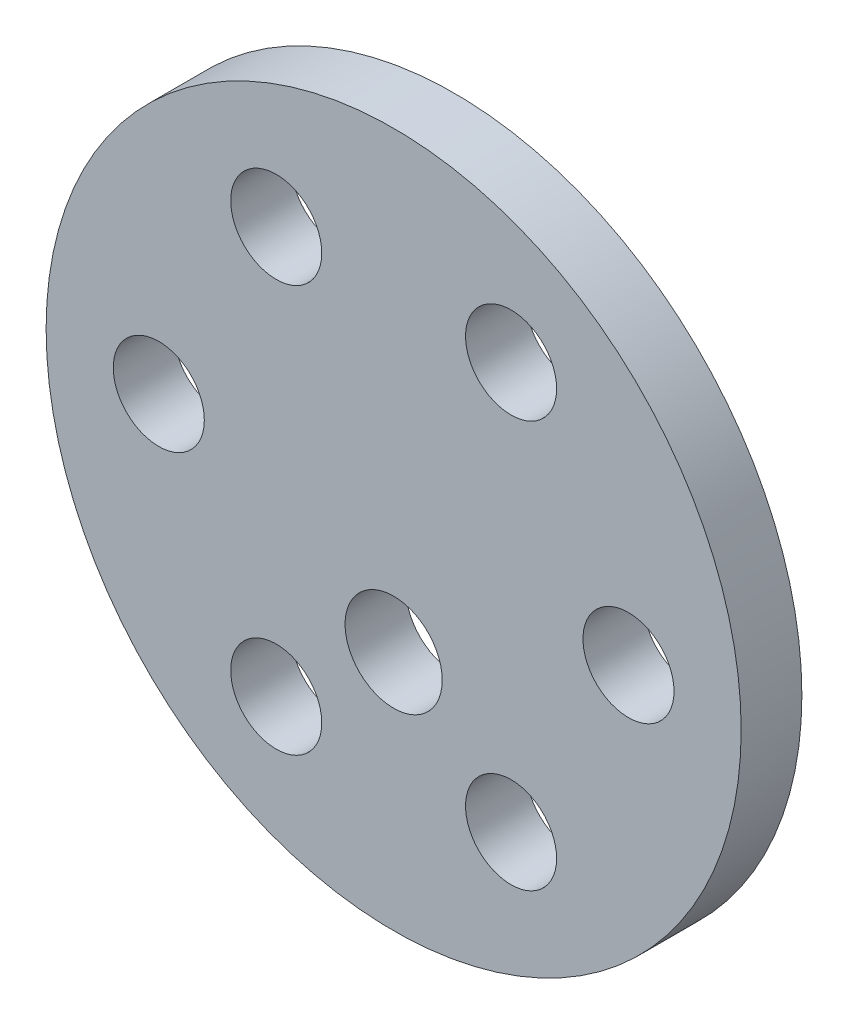
ISO-10303-21;
HEADER;
FILE_DESCRIPTION(('STEP AP214'),'2;1');
FILE_NAME('part.step','',(''),(''),'','','');
FILE_SCHEMA(('AUTOMOTIVE_DESIGN { 1 0 10303 214 1 1 1 1 }'));
ENDSEC;
DATA;
#1=APPLICATION_CONTEXT('core data for automotive mechanical design processes');
#2=APPLICATION_PROTOCOL_DEFINITION('international standard','automotive_design',2000,#1);
#3=PRODUCT_CONTEXT('',#1,'mechanical');
#4=PRODUCT('Part','Part','',(#3));
#5=PRODUCT_RELATED_PRODUCT_CATEGORY('part','',(#4));
#6=PRODUCT_DEFINITION_FORMATION('','',#4);
#7=PRODUCT_DEFINITION_CONTEXT('part definition',#1,'design');
#8=PRODUCT_DEFINITION('design','',#6,#7);
#9=PRODUCT_DEFINITION_SHAPE('','',#8);
#10=(LENGTH_UNIT() NAMED_UNIT(*) SI_UNIT(.MILLI.,.METRE.));
#11=(NAMED_UNIT(*) PLANE_ANGLE_UNIT() SI_UNIT($,.RADIAN.));
#12=(NAMED_UNIT(*) SI_UNIT($,.STERADIAN.) SOLID_ANGLE_UNIT());
#13=UNCERTAINTY_MEASURE_WITH_UNIT(LENGTH_MEASURE(1.E-05),#10,'distance_accuracy_value','');
#14=(GEOMETRIC_REPRESENTATION_CONTEXT(3) GLOBAL_UNCERTAINTY_ASSIGNED_CONTEXT((#13)) GLOBAL_UNIT_ASSIGNED_CONTEXT((#10,
#11,#12)) REPRESENTATION_CONTEXT('',''));
#15=CARTESIAN_POINT('',(0.,0.,0.));
#16=DIRECTION('',(0.,0.,1.));
#17=DIRECTION('',(1.,0.,0.));
#18=AXIS2_PLACEMENT_3D('',#15,#16,#17);
#19=CARTESIAN_POINT('',(0.,0.,4.));
#20=DIRECTION('',(0.,0.,1.));
#21=DIRECTION('',(1.,0.,0.));
#22=AXIS2_PLACEMENT_3D('',#19,#20,#21);
#23=PLANE('',#22);
#24=CARTESIAN_POINT('',(7.7375,13.4017431235642,4.));
#25=DIRECTION('',(0.,0.,1.));
#26=DIRECTION('',(1.,0.,0.));
#27=AXIS2_PLACEMENT_3D('',#24,#25,#26);
#28=CIRCLE('',#27,3.);
#29=CARTESIAN_POINT('',(10.7375,13.4017431235642,4.));
#30=VERTEX_POINT('',#29);
#31=EDGE_CURVE('E77',#30,#30,#28,.T.);
#32=ORIENTED_EDGE('',*,*,#31,.F.);
#33=EDGE_LOOP('',(#32));
#34=FACE_BOUND('',#33,.T.);
#35=CARTESIAN_POINT('',(-15.475,0.,4.));
#36=DIRECTION('',(0.,0.,1.));
#37=DIRECTION('',(1.,0.,0.));
#38=AXIS2_PLACEMENT_3D('',#35,#36,#37);
#39=CIRCLE('',#38,3.);
#40=CARTESIAN_POINT('',(-12.475,0.,4.));
#41=VERTEX_POINT('',#40);
#42=EDGE_CURVE('E65',#41,#41,#39,.T.);
#43=ORIENTED_EDGE('',*,*,#42,.F.);
#44=EDGE_LOOP('',(#43));
#45=FACE_BOUND('',#44,.T.);
#46=CARTESIAN_POINT('',(7.7375,-13.4017431235642,4.));
#47=DIRECTION('',(0.,0.,1.));
#48=DIRECTION('',(1.,0.,0.));
#49=AXIS2_PLACEMENT_3D('',#46,#47,#48);
#50=CIRCLE('',#49,3.);
#51=CARTESIAN_POINT('',(10.7375,-13.4017431235642,4.));
#52=VERTEX_POINT('',#51);
#53=EDGE_CURVE('E53',#52,#52,#50,.T.);
#54=ORIENTED_EDGE('',*,*,#53,.F.);
#55=EDGE_LOOP('',(#54));
#56=FACE_BOUND('',#55,.T.);
#57=CARTESIAN_POINT('',(0.,0.,4.));
#58=DIRECTION('',(0.,0.,1.));
#59=DIRECTION('',(1.,0.,0.));
#60=AXIS2_PLACEMENT_3D('',#57,#58,#59);
#61=CIRCLE('',#60,22.9);
#62=CARTESIAN_POINT('',(22.9,0.,4.));
#63=VERTEX_POINT('',#62);
#64=EDGE_CURVE('E10',#63,#63,#61,.T.);
#65=ORIENTED_EDGE('',*,*,#64,.T.);
#66=EDGE_LOOP('',(#65));
#67=FACE_BOUND('',#66,.T.);
#68=CARTESIAN_POINT('',(15.475,0.,4.));
#69=DIRECTION('',(0.,0.,1.));
#70=DIRECTION('',(1.,0.,0.));
#71=AXIS2_PLACEMENT_3D('',#68,#69,#70);
#72=CIRCLE('',#71,3.);
#73=CARTESIAN_POINT('',(18.475,0.,4.));
#74=VERTEX_POINT('',#73);
#75=EDGE_CURVE('E48',#74,#74,#72,.T.);
#76=ORIENTED_EDGE('',*,*,#75,.F.);
#77=EDGE_LOOP('',(#76));
#78=FACE_BOUND('',#77,.T.);
#79=CARTESIAN_POINT('',(-7.7375,-13.4017431235642,4.));
#80=DIRECTION('',(0.,0.,1.));
#81=DIRECTION('',(1.,0.,0.));
#82=AXIS2_PLACEMENT_3D('',#79,#80,#81);
#83=CIRCLE('',#82,3.);
#84=CARTESIAN_POINT('',(-4.7375,-13.4017431235642,4.));
#85=VERTEX_POINT('',#84);
#86=EDGE_CURVE('E59',#85,#85,#83,.T.);
#87=ORIENTED_EDGE('',*,*,#86,.F.);
#88=EDGE_LOOP('',(#87));
#89=FACE_BOUND('',#88,.T.);
#90=CARTESIAN_POINT('',(-7.73750000000001,13.4017431235642,4.));
#91=DIRECTION('',(0.,0.,1.));
#92=DIRECTION('',(1.,0.,0.));
#93=AXIS2_PLACEMENT_3D('',#90,#91,#92);
#94=CIRCLE('',#93,3.);
#95=CARTESIAN_POINT('',(-4.73750000000001,13.4017431235642,4.));
#96=VERTEX_POINT('',#95);
#97=EDGE_CURVE('E71',#96,#96,#94,.T.);
#98=ORIENTED_EDGE('',*,*,#97,.F.);
#99=EDGE_LOOP('',(#98));
#100=FACE_BOUND('',#99,.T.);
#101=CARTESIAN_POINT('',(0.,-7.,4.));
#102=DIRECTION('',(0.,0.,1.));
#103=DIRECTION('',(1.,0.,0.));
#104=AXIS2_PLACEMENT_3D('',#101,#102,#103);
#105=CIRCLE('',#104,3.2);
#106=CARTESIAN_POINT('',(3.2,-7.,4.));
#107=VERTEX_POINT('',#106);
#108=EDGE_CURVE('E83',#107,#107,#105,.T.);
#109=ORIENTED_EDGE('',*,*,#108,.F.);
#110=EDGE_LOOP('',(#109));
#111=FACE_BOUND('',#110,.T.);
#112=ADVANCED_FACE('F37',(#34,#45,#56,#67,#78,#89,#100,#111),#23,.T.);
#113=CARTESIAN_POINT('',(0.,0.,0.));
#114=DIRECTION('',(0.,0.,1.));
#115=DIRECTION('',(1.,0.,0.));
#116=AXIS2_PLACEMENT_3D('',#113,#114,#115);
#117=PLANE('',#116);
#118=CARTESIAN_POINT('',(0.,0.,0.));
#119=DIRECTION('',(0.,0.,1.));
#120=DIRECTION('',(1.,0.,0.));
#121=AXIS2_PLACEMENT_3D('',#118,#119,#120);
#122=CIRCLE('',#121,22.9);
#123=CARTESIAN_POINT('',(22.9,0.,0.));
#124=VERTEX_POINT('',#123);
#125=EDGE_CURVE('E41',#124,#124,#122,.T.);
#126=ORIENTED_EDGE('',*,*,#125,.F.);
#127=EDGE_LOOP('',(#126));
#128=FACE_BOUND('',#127,.T.);
#129=CARTESIAN_POINT('',(15.475,0.,0.));
#130=DIRECTION('',(0.,0.,1.));
#131=DIRECTION('',(1.,0.,0.));
#132=AXIS2_PLACEMENT_3D('',#129,#130,#131);
#133=CIRCLE('',#132,3.);
#134=CARTESIAN_POINT('',(18.475,0.,0.));
#135=VERTEX_POINT('',#134);
#136=EDGE_CURVE('E50',#135,#135,#133,.T.);
#137=ORIENTED_EDGE('',*,*,#136,.T.);
#138=EDGE_LOOP('',(#137));
#139=FACE_BOUND('',#138,.T.);
#140=CARTESIAN_POINT('',(7.7375,-13.4017431235642,0.));
#141=DIRECTION('',(0.,0.,1.));
#142=DIRECTION('',(1.,0.,0.));
#143=AXIS2_PLACEMENT_3D('',#140,#141,#142);
#144=CIRCLE('',#143,3.);
#145=CARTESIAN_POINT('',(10.7375,-13.4017431235642,0.));
#146=VERTEX_POINT('',#145);
#147=EDGE_CURVE('E56',#146,#146,#144,.T.);
#148=ORIENTED_EDGE('',*,*,#147,.T.);
#149=EDGE_LOOP('',(#148));
#150=FACE_BOUND('',#149,.T.);
#151=CARTESIAN_POINT('',(-7.7375,-13.4017431235642,0.));
#152=DIRECTION('',(0.,0.,1.));
#153=DIRECTION('',(1.,0.,0.));
#154=AXIS2_PLACEMENT_3D('',#151,#152,#153);
#155=CIRCLE('',#154,3.);
#156=CARTESIAN_POINT('',(-4.7375,-13.4017431235642,0.));
#157=VERTEX_POINT('',#156);
#158=EDGE_CURVE('E62',#157,#157,#155,.T.);
#159=ORIENTED_EDGE('',*,*,#158,.T.);
#160=EDGE_LOOP('',(#159));
#161=FACE_BOUND('',#160,.T.);
#162=CARTESIAN_POINT('',(-15.475,0.,0.));
#163=DIRECTION('',(0.,0.,1.));
#164=DIRECTION('',(1.,0.,0.));
#165=AXIS2_PLACEMENT_3D('',#162,#163,#164);
#166=CIRCLE('',#165,3.);
#167=CARTESIAN_POINT('',(-12.475,0.,0.));
#168=VERTEX_POINT('',#167);
#169=EDGE_CURVE('E68',#168,#168,#166,.T.);
#170=ORIENTED_EDGE('',*,*,#169,.T.);
#171=EDGE_LOOP('',(#170));
#172=FACE_BOUND('',#171,.T.);
#173=CARTESIAN_POINT('',(-7.73750000000001,13.4017431235642,0.));
#174=DIRECTION('',(0.,0.,1.));
#175=DIRECTION('',(1.,0.,0.));
#176=AXIS2_PLACEMENT_3D('',#173,#174,#175);
#177=CIRCLE('',#176,3.);
#178=CARTESIAN_POINT('',(-4.73750000000001,13.4017431235642,0.));
#179=VERTEX_POINT('',#178);
#180=EDGE_CURVE('E74',#179,#179,#177,.T.);
#181=ORIENTED_EDGE('',*,*,#180,.T.);
#182=EDGE_LOOP('',(#181));
#183=FACE_BOUND('',#182,.T.);
#184=CARTESIAN_POINT('',(7.7375,13.4017431235642,0.));
#185=DIRECTION('',(0.,0.,1.));
#186=DIRECTION('',(1.,0.,0.));
#187=AXIS2_PLACEMENT_3D('',#184,#185,#186);
#188=CIRCLE('',#187,3.);
#189=CARTESIAN_POINT('',(10.7375,13.4017431235642,0.));
#190=VERTEX_POINT('',#189);
#191=EDGE_CURVE('E80',#190,#190,#188,.T.);
#192=ORIENTED_EDGE('',*,*,#191,.T.);
#193=EDGE_LOOP('',(#192));
#194=FACE_BOUND('',#193,.T.);
#195=CARTESIAN_POINT('',(0.,-7.,0.));
#196=DIRECTION('',(0.,0.,1.));
#197=DIRECTION('',(1.,0.,0.));
#198=AXIS2_PLACEMENT_3D('',#195,#196,#197);
#199=CIRCLE('',#198,3.2);
#200=CARTESIAN_POINT('',(3.2,-7.,0.));
#201=VERTEX_POINT('',#200);
#202=EDGE_CURVE('E86',#201,#201,#199,.T.);
#203=ORIENTED_EDGE('',*,*,#202,.T.);
#204=EDGE_LOOP('',(#203));
#205=FACE_BOUND('',#204,.T.);
#206=ADVANCED_FACE('F96',(#128,#139,#150,#161,#172,#183,#194,#205),#117,.F.);
#207=CARTESIAN_POINT('',(0.,0.,4.));
#208=DIRECTION('',(0.,0.,-1.));
#209=DIRECTION('',(-1.,0.,0.));
#210=AXIS2_PLACEMENT_3D('',#207,#208,#209);
#211=CYLINDRICAL_SURFACE('',#210,22.9);
#212=ORIENTED_EDGE('',*,*,#64,.F.);
#213=EDGE_LOOP('',(#212));
#214=FACE_BOUND('',#213,.T.);
#215=ORIENTED_EDGE('',*,*,#125,.T.);
#216=EDGE_LOOP('',(#215));
#217=FACE_BOUND('',#216,.T.);
#218=ADVANCED_FACE('F39',(#214,#217),#211,.T.);
#219=CARTESIAN_POINT('',(15.475,0.,4.));
#220=DIRECTION('',(0.,0.,-1.));
#221=DIRECTION('',(-1.,0.,0.));
#222=AXIS2_PLACEMENT_3D('',#219,#220,#221);
#223=CYLINDRICAL_SURFACE('',#222,3.);
#224=ORIENTED_EDGE('',*,*,#75,.T.);
#225=EDGE_LOOP('',(#224));
#226=FACE_BOUND('',#225,.T.);
#227=ORIENTED_EDGE('',*,*,#136,.F.);
#228=EDGE_LOOP('',(#227));
#229=FACE_BOUND('',#228,.T.);
#230=ADVANCED_FACE('F106',(#226,#229),#223,.F.);
#231=CARTESIAN_POINT('',(7.7375,-13.4017431235642,4.));
#232=DIRECTION('',(0.,0.,-1.));
#233=DIRECTION('',(-1.,0.,0.));
#234=AXIS2_PLACEMENT_3D('',#231,#232,#233);
#235=CYLINDRICAL_SURFACE('',#234,3.);
#236=ORIENTED_EDGE('',*,*,#53,.T.);
#237=EDGE_LOOP('',(#236));
#238=FACE_BOUND('',#237,.T.);
#239=ORIENTED_EDGE('',*,*,#147,.F.);
#240=EDGE_LOOP('',(#239));
#241=FACE_BOUND('',#240,.T.);
#242=ADVANCED_FACE('F109',(#238,#241),#235,.F.);
#243=CARTESIAN_POINT('',(-7.7375,-13.4017431235642,4.));
#244=DIRECTION('',(0.,0.,-1.));
#245=DIRECTION('',(-1.,0.,0.));
#246=AXIS2_PLACEMENT_3D('',#243,#244,#245);
#247=CYLINDRICAL_SURFACE('',#246,3.);
#248=ORIENTED_EDGE('',*,*,#86,.T.);
#249=EDGE_LOOP('',(#248));
#250=FACE_BOUND('',#249,.T.);
#251=ORIENTED_EDGE('',*,*,#158,.F.);
#252=EDGE_LOOP('',(#251));
#253=FACE_BOUND('',#252,.T.);
#254=ADVANCED_FACE('F113',(#250,#253),#247,.F.);
#255=CARTESIAN_POINT('',(-15.475,0.,4.));
#256=DIRECTION('',(0.,0.,-1.));
#257=DIRECTION('',(-1.,0.,0.));
#258=AXIS2_PLACEMENT_3D('',#255,#256,#257);
#259=CYLINDRICAL_SURFACE('',#258,3.);
#260=ORIENTED_EDGE('',*,*,#42,.T.);
#261=EDGE_LOOP('',(#260));
#262=FACE_BOUND('',#261,.T.);
#263=ORIENTED_EDGE('',*,*,#169,.F.);
#264=EDGE_LOOP('',(#263));
#265=FACE_BOUND('',#264,.T.);
#266=ADVANCED_FACE('F117',(#262,#265),#259,.F.);
#267=CARTESIAN_POINT('',(-7.73750000000001,13.4017431235642,4.));
#268=DIRECTION('',(0.,0.,-1.));
#269=DIRECTION('',(-1.,0.,0.));
#270=AXIS2_PLACEMENT_3D('',#267,#268,#269);
#271=CYLINDRICAL_SURFACE('',#270,3.);
#272=ORIENTED_EDGE('',*,*,#97,.T.);
#273=EDGE_LOOP('',(#272));
#274=FACE_BOUND('',#273,.T.);
#275=ORIENTED_EDGE('',*,*,#180,.F.);
#276=EDGE_LOOP('',(#275));
#277=FACE_BOUND('',#276,.T.);
#278=ADVANCED_FACE('F121',(#274,#277),#271,.F.);
#279=CARTESIAN_POINT('',(7.7375,13.4017431235642,4.));
#280=DIRECTION('',(0.,0.,-1.));
#281=DIRECTION('',(-1.,0.,0.));
#282=AXIS2_PLACEMENT_3D('',#279,#280,#281);
#283=CYLINDRICAL_SURFACE('',#282,3.);
#284=ORIENTED_EDGE('',*,*,#31,.T.);
#285=EDGE_LOOP('',(#284));
#286=FACE_BOUND('',#285,.T.);
#287=ORIENTED_EDGE('',*,*,#191,.F.);
#288=EDGE_LOOP('',(#287));
#289=FACE_BOUND('',#288,.T.);
#290=ADVANCED_FACE('F125',(#286,#289),#283,.F.);
#291=CARTESIAN_POINT('',(0.,-7.,4.));
#292=DIRECTION('',(0.,0.,-1.));
#293=DIRECTION('',(-1.,0.,0.));
#294=AXIS2_PLACEMENT_3D('',#291,#292,#293);
#295=CYLINDRICAL_SURFACE('',#294,3.2);
#296=ORIENTED_EDGE('',*,*,#108,.T.);
#297=EDGE_LOOP('',(#296));
#298=FACE_BOUND('',#297,.T.);
#299=ORIENTED_EDGE('',*,*,#202,.F.);
#300=EDGE_LOOP('',(#299));
#301=FACE_BOUND('',#300,.T.);
#302=ADVANCED_FACE('F92',(#298,#301),#295,.F.);
#303=CLOSED_SHELL('',(#112,#206,#218,#230,#242,#254,#266,#278,#290,#302));
#304=MANIFOLD_SOLID_BREP('B2',#303);
#305=ADVANCED_BREP_SHAPE_REPRESENTATION('',(#18,#304),#14);
#306=SHAPE_DEFINITION_REPRESENTATION(#9,#305);
ENDSEC;
END-ISO-10303-21;
